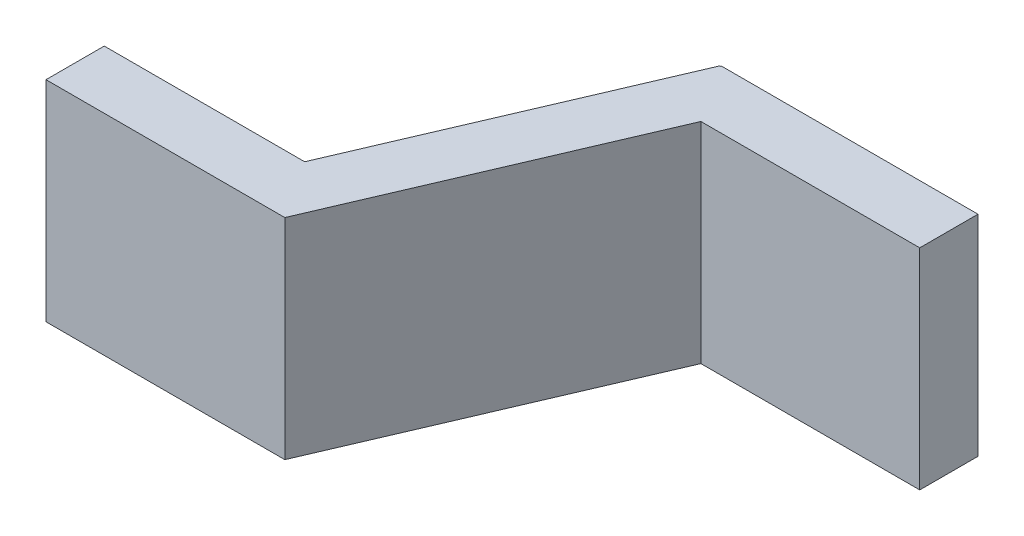
ISO-10303-21;
HEADER;
FILE_DESCRIPTION(('STEP AP214'),'2;1');
FILE_NAME('part.step','',(''),(''),'','','');
FILE_SCHEMA(('AUTOMOTIVE_DESIGN { 1 0 10303 214 1 1 1 1 }'));
ENDSEC;
DATA;
#1=APPLICATION_CONTEXT('core data for automotive mechanical design processes');
#2=APPLICATION_PROTOCOL_DEFINITION('international standard','automotive_design',2000,#1);
#3=PRODUCT_CONTEXT('',#1,'mechanical');
#4=PRODUCT('Part','Part','',(#3));
#5=PRODUCT_RELATED_PRODUCT_CATEGORY('part','',(#4));
#6=PRODUCT_DEFINITION_FORMATION('','',#4);
#7=PRODUCT_DEFINITION_CONTEXT('part definition',#1,'design');
#8=PRODUCT_DEFINITION('design','',#6,#7);
#9=PRODUCT_DEFINITION_SHAPE('','',#8);
#10=(LENGTH_UNIT() NAMED_UNIT(*) SI_UNIT(.MILLI.,.METRE.));
#11=(NAMED_UNIT(*) PLANE_ANGLE_UNIT() SI_UNIT($,.RADIAN.));
#12=(NAMED_UNIT(*) SI_UNIT($,.STERADIAN.) SOLID_ANGLE_UNIT());
#13=UNCERTAINTY_MEASURE_WITH_UNIT(LENGTH_MEASURE(1.E-05),#10,'distance_accuracy_value','');
#14=(GEOMETRIC_REPRESENTATION_CONTEXT(3) GLOBAL_UNCERTAINTY_ASSIGNED_CONTEXT((#13)) GLOBAL_UNIT_ASSIGNED_CONTEXT((#10,
#11,#12)) REPRESENTATION_CONTEXT('',''));
#15=CARTESIAN_POINT('',(0.,0.,0.));
#16=DIRECTION('',(0.,0.,1.));
#17=DIRECTION('',(1.,0.,0.));
#18=AXIS2_PLACEMENT_3D('',#15,#16,#17);
#19=CARTESIAN_POINT('',(11.558086453539,9.82,0.0006058345056003));
#20=DIRECTION('',(-0.919135450912914,0.,-0.393941649073963));
#21=DIRECTION('',(-0.393941649073963,0.,0.919135450912914));
#22=AXIS2_PLACEMENT_3D('',#19,#20,#21);
#23=PLANE('',#22);
#24=DIRECTION('',(0.,1.,0.));
#25=VECTOR('',#24,1.);
#26=CARTESIAN_POINT('',(11.344046008361,9.82,0.5));
#27=LINE('',#26,#25);
#28=CARTESIAN_POINT('',(11.344046008361,9.82,0.5));
#29=VERTEX_POINT('',#28);
#30=CARTESIAN_POINT('',(11.344046008361,10.180000014305,0.5));
#31=VERTEX_POINT('',#30);
#32=EDGE_CURVE('E94',#29,#31,#27,.T.);
#33=ORIENTED_EDGE('',*,*,#32,.T.);
#34=DIRECTION('',(-0.393941649073123,0.,0.919135450913275));
#35=VECTOR('',#34,1.);
#36=CARTESIAN_POINT('',(11.558086453539,10.180000014305,0.000605834505600302));
#37=LINE('',#36,#35);
#38=CARTESIAN_POINT('',(11.558086453539,10.180000014305,0.000605834505577237));
#39=VERTEX_POINT('',#38);
#40=EDGE_CURVE('E121',#39,#31,#37,.T.);
#41=ORIENTED_EDGE('',*,*,#40,.F.);
#42=DIRECTION('',(0.,1.,0.));
#43=VECTOR('',#42,1.);
#44=CARTESIAN_POINT('',(11.558086453539,9.82,0.000605834505554305));
#45=LINE('',#44,#43);
#46=CARTESIAN_POINT('',(11.558086453539,9.82,0.000605834505584969));
#47=VERTEX_POINT('',#46);
#48=EDGE_CURVE('E110',#39,#47,#45,.F.);
#49=ORIENTED_EDGE('',*,*,#48,.T.);
#50=DIRECTION('',(-0.393941649073123,0.,0.919135450913275));
#51=VECTOR('',#50,1.);
#52=CARTESIAN_POINT('',(11.558086453539,9.82,0.000605834505600302));
#53=LINE('',#52,#51);
#54=EDGE_CURVE('E100',#47,#29,#53,.T.);
#55=ORIENTED_EDGE('',*,*,#54,.T.);
#56=EDGE_LOOP('',(#33,#41,#49,#55));
#57=FACE_BOUND('',#56,.T.);
#58=ADVANCED_FACE('F17',(#57),#23,.T.);
#59=CARTESIAN_POINT('',(11.,9.82,0.5));
#60=DIRECTION('',(0.,0.,1.));
#61=DIRECTION('',(1.,0.,0.));
#62=AXIS2_PLACEMENT_3D('',#59,#60,#61);
#63=PLANE('',#62);
#64=DIRECTION('',(1.,0.,0.));
#65=VECTOR('',#64,1.);
#66=CARTESIAN_POINT('',(11.65,10.180000014305,0.5));
#67=LINE('',#66,#65);
#68=CARTESIAN_POINT('',(11.,10.180000014305,0.5));
#69=VERTEX_POINT('',#68);
#70=EDGE_CURVE('E79',#31,#69,#67,.F.);
#71=ORIENTED_EDGE('',*,*,#70,.F.);
#72=ORIENTED_EDGE('',*,*,#32,.F.);
#73=DIRECTION('',(1.,0.,0.));
#74=VECTOR('',#73,1.);
#75=CARTESIAN_POINT('',(11.65,9.82,0.5));
#76=LINE('',#75,#74);
#77=CARTESIAN_POINT('',(11.,9.82,0.5));
#78=VERTEX_POINT('',#77);
#79=EDGE_CURVE('E169',#29,#78,#76,.F.);
#80=ORIENTED_EDGE('',*,*,#79,.T.);
#81=DIRECTION('',(0.,1.,0.));
#82=VECTOR('',#81,1.);
#83=CARTESIAN_POINT('',(11.,9.82,0.5));
#84=LINE('',#83,#82);
#85=EDGE_CURVE('E87',#78,#69,#84,.T.);
#86=ORIENTED_EDGE('',*,*,#85,.T.);
#87=EDGE_LOOP('',(#71,#72,#80,#86));
#88=FACE_BOUND('',#87,.T.);
#89=ADVANCED_FACE('F198',(#88),#63,.F.);
#90=CARTESIAN_POINT('',(11.,9.82,0.5));
#91=DIRECTION('',(1.,0.,0.));
#92=DIRECTION('',(0.,0.,-1.));
#93=AXIS2_PLACEMENT_3D('',#90,#91,#92);
#94=PLANE('',#93);
#95=ORIENTED_EDGE('',*,*,#85,.F.);
#96=DIRECTION('',(0.,0.,1.));
#97=VECTOR('',#96,1.);
#98=CARTESIAN_POINT('',(11.,9.82,0.04));
#99=LINE('',#98,#97);
#100=CARTESIAN_POINT('',(11.,9.82,0.60000000149));
#101=VERTEX_POINT('',#100);
#102=EDGE_CURVE('E153',#78,#101,#99,.T.);
#103=ORIENTED_EDGE('',*,*,#102,.T.);
#104=DIRECTION('',(0.,1.,0.));
#105=VECTOR('',#104,1.);
#106=CARTESIAN_POINT('',(11.,9.82,0.60000000149));
#107=LINE('',#106,#105);
#108=CARTESIAN_POINT('',(11.,10.180000014305,0.60000000149));
#109=VERTEX_POINT('',#108);
#110=EDGE_CURVE('E117',#109,#101,#107,.F.);
#111=ORIENTED_EDGE('',*,*,#110,.F.);
#112=DIRECTION('',(0.,0.,1.));
#113=VECTOR('',#112,1.);
#114=CARTESIAN_POINT('',(11.,10.180000014305,0.04));
#115=LINE('',#114,#113);
#116=EDGE_CURVE('E71',#69,#109,#115,.T.);
#117=ORIENTED_EDGE('',*,*,#116,.F.);
#118=EDGE_LOOP('',(#95,#103,#111,#117));
#119=FACE_BOUND('',#118,.T.);
#120=ADVANCED_FACE('F202',(#119),#94,.F.);
#121=CARTESIAN_POINT('',(11.999999997616,9.82,0.));
#122=DIRECTION('',(1.,0.,0.));
#123=DIRECTION('',(0.,0.,-1.));
#124=AXIS2_PLACEMENT_3D('',#121,#122,#123);
#125=PLANE('',#124);
#126=DIRECTION('',(0.,0.,1.));
#127=VECTOR('',#126,1.);
#128=CARTESIAN_POINT('',(11.999999997616,9.82,0.04));
#129=LINE('',#128,#127);
#130=CARTESIAN_POINT('',(11.999999997616,9.82,0.10000000149));
#131=VERTEX_POINT('',#130);
#132=CARTESIAN_POINT('',(11.999999997616,9.82,0.));
#133=VERTEX_POINT('',#132);
#134=EDGE_CURVE('E179',#131,#133,#129,.F.);
#135=ORIENTED_EDGE('',*,*,#134,.T.);
#136=DIRECTION('',(0.,1.,0.));
#137=VECTOR('',#136,1.);
#138=CARTESIAN_POINT('',(11.999999997616,9.82,0.));
#139=LINE('',#138,#137);
#140=CARTESIAN_POINT('',(11.999999997616,10.180000014305,0.));
#141=VERTEX_POINT('',#140);
#142=EDGE_CURVE('E174',#133,#141,#139,.T.);
#143=ORIENTED_EDGE('',*,*,#142,.T.);
#144=DIRECTION('',(0.,0.,1.));
#145=VECTOR('',#144,1.);
#146=CARTESIAN_POINT('',(11.999999997616,10.180000014305,0.04));
#147=LINE('',#146,#145);
#148=CARTESIAN_POINT('',(11.999999997616,10.180000014305,0.10000000149));
#149=VERTEX_POINT('',#148);
#150=EDGE_CURVE('E155',#149,#141,#147,.F.);
#151=ORIENTED_EDGE('',*,*,#150,.F.);
#152=DIRECTION('',(0.,1.,0.));
#153=VECTOR('',#152,1.);
#154=CARTESIAN_POINT('',(11.999999997616,9.82,0.10000000149));
#155=LINE('',#154,#153);
#156=EDGE_CURVE('E125',#131,#149,#155,.T.);
#157=ORIENTED_EDGE('',*,*,#156,.F.);
#158=EDGE_LOOP('',(#135,#143,#151,#157));
#159=FACE_BOUND('',#158,.T.);
#160=ADVANCED_FACE('F228',(#159),#125,.T.);
#161=CARTESIAN_POINT('',(11.56,9.82,0.));
#162=DIRECTION('',(0.,0.,1.));
#163=DIRECTION('',(1.,0.,0.));
#164=AXIS2_PLACEMENT_3D('',#161,#162,#163);
#165=PLANE('',#164);
#166=DIRECTION('',(1.,0.,0.));
#167=VECTOR('',#166,1.);
#168=CARTESIAN_POINT('',(11.65,9.82,0.));
#169=LINE('',#168,#167);
#170=CARTESIAN_POINT('',(11.56,9.82,0.));
#171=VERTEX_POINT('',#170);
#172=EDGE_CURVE('E150',#133,#171,#169,.F.);
#173=ORIENTED_EDGE('',*,*,#172,.T.);
#174=DIRECTION('',(0.,1.,0.));
#175=VECTOR('',#174,1.);
#176=CARTESIAN_POINT('',(11.56,9.82,0.));
#177=LINE('',#176,#175);
#178=CARTESIAN_POINT('',(11.56,10.180000014305,0.));
#179=VERTEX_POINT('',#178);
#180=EDGE_CURVE('E164',#171,#179,#177,.T.);
#181=ORIENTED_EDGE('',*,*,#180,.T.);
#182=DIRECTION('',(1.,0.,0.));
#183=VECTOR('',#182,1.);
#184=CARTESIAN_POINT('',(11.65,10.180000014305,0.));
#185=LINE('',#184,#183);
#186=EDGE_CURVE('E154',#141,#179,#185,.F.);
#187=ORIENTED_EDGE('',*,*,#186,.F.);
#188=ORIENTED_EDGE('',*,*,#142,.F.);
#189=EDGE_LOOP('',(#173,#181,#187,#188));
#190=FACE_BOUND('',#189,.T.);
#191=ADVANCED_FACE('F232',(#190),#165,.F.);
#192=CARTESIAN_POINT('',(11.56,9.82,0.));
#193=DIRECTION('',(1.,0.,0.));
#194=DIRECTION('',(0.,0.,-1.));
#195=AXIS2_PLACEMENT_3D('',#192,#193,#194);
#196=PLANE('',#195);
#197=DIRECTION('',(0.,1.,0.));
#198=VECTOR('',#197,1.);
#199=CARTESIAN_POINT('',(11.56,9.82,0.00142598092431268));
#200=LINE('',#199,#198);
#201=CARTESIAN_POINT('',(11.56,9.82,0.00142598092431734));
#202=VERTEX_POINT('',#201);
#203=CARTESIAN_POINT('',(11.56,10.180000014305,0.00142598092431734));
#204=VERTEX_POINT('',#203);
#205=EDGE_CURVE('E118',#202,#204,#200,.T.);
#206=ORIENTED_EDGE('',*,*,#205,.T.);
#207=DIRECTION('',(0.,0.,1.));
#208=VECTOR('',#207,1.);
#209=CARTESIAN_POINT('',(11.56,10.180000014305,0.04));
#210=LINE('',#209,#208);
#211=EDGE_CURVE('E123',#179,#204,#210,.T.);
#212=ORIENTED_EDGE('',*,*,#211,.F.);
#213=ORIENTED_EDGE('',*,*,#180,.F.);
#214=DIRECTION('',(0.,0.,-1.));
#215=VECTOR('',#214,1.);
#216=CARTESIAN_POINT('',(11.56,9.82,0.));
#217=LINE('',#216,#215);
#218=EDGE_CURVE('E147',#171,#202,#217,.F.);
#219=ORIENTED_EDGE('',*,*,#218,.T.);
#220=EDGE_LOOP('',(#206,#212,#213,#219));
#221=FACE_BOUND('',#220,.T.);
#222=ADVANCED_FACE('F234',(#221),#196,.F.);
#223=CARTESIAN_POINT('',(11.65,9.82,0.04));
#224=DIRECTION('',(-0.393941649073963,0.,0.919135450912914));
#225=DIRECTION('',(0.919135450912914,0.,0.393941649073963));
#226=AXIS2_PLACEMENT_3D('',#223,#224,#225);
#227=PLANE('',#226);
#228=DIRECTION('',(-0.919135450920459,0.,-0.393941649056361));
#229=VECTOR('',#228,1.);
#230=CARTESIAN_POINT('',(11.56,10.180000014305,0.001425980924322));
#231=LINE('',#230,#229);
#232=EDGE_CURVE('E113',#204,#39,#231,.T.);
#233=ORIENTED_EDGE('',*,*,#232,.F.);
#234=ORIENTED_EDGE('',*,*,#205,.F.);
#235=DIRECTION('',(-0.919135450920459,0.,-0.393941649056361));
#236=VECTOR('',#235,1.);
#237=CARTESIAN_POINT('',(11.56,9.82,0.001425980924322));
#238=LINE('',#237,#236);
#239=EDGE_CURVE('E114',#202,#47,#238,.T.);
#240=ORIENTED_EDGE('',*,*,#239,.T.);
#241=ORIENTED_EDGE('',*,*,#48,.F.);
#242=EDGE_LOOP('',(#233,#234,#240,#241));
#243=FACE_BOUND('',#242,.T.);
#244=ADVANCED_FACE('F112',(#243),#227,.F.);
#245=CARTESIAN_POINT('',(11.,9.82,0.60000000149));
#246=DIRECTION('',(0.,0.,1.));
#247=DIRECTION('',(1.,0.,0.));
#248=AXIS2_PLACEMENT_3D('',#245,#246,#247);
#249=PLANE('',#248);
#250=DIRECTION('',(0.,1.,0.));
#251=VECTOR('',#250,1.);
#252=CARTESIAN_POINT('',(11.4099838806682,9.82,0.60000000149));
#253=LINE('',#252,#251);
#254=CARTESIAN_POINT('',(11.4099838806682,9.82,0.60000000149));
#255=VERTEX_POINT('',#254);
#256=CARTESIAN_POINT('',(11.4099838806682,10.180000014305,0.60000000149));
#257=VERTEX_POINT('',#256);
#258=EDGE_CURVE('E144',#255,#257,#253,.T.);
#259=ORIENTED_EDGE('',*,*,#258,.T.);
#260=DIRECTION('',(1.,0.,0.));
#261=VECTOR('',#260,1.);
#262=CARTESIAN_POINT('',(11.65,10.180000014305,0.60000000149));
#263=LINE('',#262,#261);
#264=EDGE_CURVE('E20',#109,#257,#263,.T.);
#265=ORIENTED_EDGE('',*,*,#264,.F.);
#266=ORIENTED_EDGE('',*,*,#110,.T.);
#267=DIRECTION('',(1.,0.,0.));
#268=VECTOR('',#267,1.);
#269=CARTESIAN_POINT('',(11.,9.82,0.60000000149));
#270=LINE('',#269,#268);
#271=EDGE_CURVE('E151',#101,#255,#270,.T.);
#272=ORIENTED_EDGE('',*,*,#271,.T.);
#273=EDGE_LOOP('',(#259,#265,#266,#272));
#274=FACE_BOUND('',#273,.T.);
#275=ADVANCED_FACE('F205',(#274),#249,.T.);
#276=CARTESIAN_POINT('',(11.65,10.180000014305,0.04));
#277=DIRECTION('',(0.,1.,0.));
#278=DIRECTION('',(0.,0.,1.));
#279=AXIS2_PLACEMENT_3D('',#276,#277,#278);
#280=PLANE('',#279);
#281=ORIENTED_EDGE('',*,*,#211,.T.);
#282=ORIENTED_EDGE('',*,*,#232,.T.);
#283=ORIENTED_EDGE('',*,*,#40,.T.);
#284=ORIENTED_EDGE('',*,*,#70,.T.);
#285=ORIENTED_EDGE('',*,*,#116,.T.);
#286=ORIENTED_EDGE('',*,*,#264,.T.);
#287=DIRECTION('',(-0.393941649073964,0.,0.919135450912914));
#288=VECTOR('',#287,1.);
#289=CARTESIAN_POINT('',(11.6242839866442,10.180000014305,0.100000001490094));
#290=LINE('',#289,#288);
#291=CARTESIAN_POINT('',(11.6242839866442,10.180000014305,0.100000001490047));
#292=VERTEX_POINT('',#291);
#293=EDGE_CURVE('E141',#257,#292,#290,.F.);
#294=ORIENTED_EDGE('',*,*,#293,.T.);
#295=DIRECTION('',(1.,0.,0.));
#296=VECTOR('',#295,1.);
#297=CARTESIAN_POINT('',(11.56,10.180000014305,0.10000000149));
#298=LINE('',#297,#296);
#299=EDGE_CURVE('E170',#149,#292,#298,.F.);
#300=ORIENTED_EDGE('',*,*,#299,.F.);
#301=ORIENTED_EDGE('',*,*,#150,.T.);
#302=ORIENTED_EDGE('',*,*,#186,.T.);
#303=EDGE_LOOP('',(#281,#282,#283,#284,#285,#286,#294,#300,#301,#302));
#304=FACE_BOUND('',#303,.T.);
#305=ADVANCED_FACE('F120',(#304),#280,.T.);
#306=CARTESIAN_POINT('',(11.56,9.82,0.10000000149));
#307=DIRECTION('',(0.,0.,1.));
#308=DIRECTION('',(1.,0.,0.));
#309=AXIS2_PLACEMENT_3D('',#306,#307,#308);
#310=PLANE('',#309);
#311=ORIENTED_EDGE('',*,*,#299,.T.);
#312=DIRECTION('',(0.,1.,0.));
#313=VECTOR('',#312,1.);
#314=CARTESIAN_POINT('',(11.6242839866442,9.82,0.100000001490094));
#315=LINE('',#314,#313);
#316=CARTESIAN_POINT('',(11.6242839866442,9.82,0.100000001490047));
#317=VERTEX_POINT('',#316);
#318=EDGE_CURVE('E26',#292,#317,#315,.F.);
#319=ORIENTED_EDGE('',*,*,#318,.T.);
#320=DIRECTION('',(1.,0.,0.));
#321=VECTOR('',#320,1.);
#322=CARTESIAN_POINT('',(11.65,9.82,0.10000000149));
#323=LINE('',#322,#321);
#324=EDGE_CURVE('E34',#317,#131,#323,.T.);
#325=ORIENTED_EDGE('',*,*,#324,.T.);
#326=ORIENTED_EDGE('',*,*,#156,.T.);
#327=EDGE_LOOP('',(#311,#319,#325,#326));
#328=FACE_BOUND('',#327,.T.);
#329=ADVANCED_FACE('F223',(#328),#310,.T.);
#330=CARTESIAN_POINT('',(11.65,9.82,0.04));
#331=DIRECTION('',(0.,1.,0.));
#332=DIRECTION('',(0.,0.,1.));
#333=AXIS2_PLACEMENT_3D('',#330,#331,#332);
#334=PLANE('',#333);
#335=ORIENTED_EDGE('',*,*,#218,.F.);
#336=ORIENTED_EDGE('',*,*,#172,.F.);
#337=ORIENTED_EDGE('',*,*,#134,.F.);
#338=ORIENTED_EDGE('',*,*,#324,.F.);
#339=DIRECTION('',(0.393941649073964,0.,-0.919135450912914));
#340=VECTOR('',#339,1.);
#341=CARTESIAN_POINT('',(11.4098164411035,9.82,0.600390667570103));
#342=LINE('',#341,#340);
#343=EDGE_CURVE('E11',#317,#255,#342,.F.);
#344=ORIENTED_EDGE('',*,*,#343,.T.);
#345=ORIENTED_EDGE('',*,*,#271,.F.);
#346=ORIENTED_EDGE('',*,*,#102,.F.);
#347=ORIENTED_EDGE('',*,*,#79,.F.);
#348=ORIENTED_EDGE('',*,*,#54,.F.);
#349=ORIENTED_EDGE('',*,*,#239,.F.);
#350=EDGE_LOOP('',(#335,#336,#337,#338,#344,#345,#346,#347,#348,#349));
#351=FACE_BOUND('',#350,.T.);
#352=ADVANCED_FACE('F200',(#351),#334,.F.);
#353=CARTESIAN_POINT('',(11.65,9.82,0.04));
#354=DIRECTION('',(-0.919135450912914,0.,-0.393941649073963));
#355=DIRECTION('',(-0.393941649073963,0.,0.919135450912914));
#356=AXIS2_PLACEMENT_3D('',#353,#354,#355);
#357=PLANE('',#356);
#358=ORIENTED_EDGE('',*,*,#318,.F.);
#359=ORIENTED_EDGE('',*,*,#293,.F.);
#360=ORIENTED_EDGE('',*,*,#258,.F.);
#361=ORIENTED_EDGE('',*,*,#343,.F.);
#362=EDGE_LOOP('',(#358,#359,#360,#361));
#363=FACE_BOUND('',#362,.T.);
#364=ADVANCED_FACE('F210',(#363),#357,.F.);
#365=CLOSED_SHELL('',(#58,#89,#120,#160,#191,#222,#244,#275,#305,#329,#352,#364));
#366=MANIFOLD_SOLID_BREP('B1',#365);
#367=ADVANCED_BREP_SHAPE_REPRESENTATION('',(#18,#366),#14);
#368=SHAPE_DEFINITION_REPRESENTATION(#9,#367);
ENDSEC;
END-ISO-10303-21;
